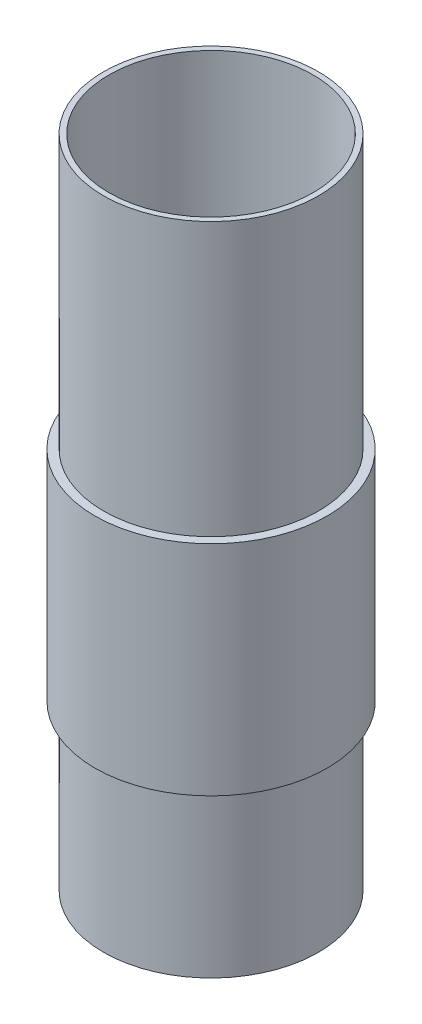
ISO-10303-21;
HEADER;
FILE_DESCRIPTION(('STEP AP214'),'2;1');
FILE_NAME('part.step','',(''),(''),'','','');
FILE_SCHEMA(('AUTOMOTIVE_DESIGN { 1 0 10303 214 1 1 1 1 }'));
ENDSEC;
DATA;
#1=APPLICATION_CONTEXT('core data for automotive mechanical design processes');
#2=APPLICATION_PROTOCOL_DEFINITION('international standard','automotive_design',2000,#1);
#3=PRODUCT_CONTEXT('',#1,'mechanical');
#4=PRODUCT('Part','Part','',(#3));
#5=PRODUCT_RELATED_PRODUCT_CATEGORY('part','',(#4));
#6=PRODUCT_DEFINITION_FORMATION('','',#4);
#7=PRODUCT_DEFINITION_CONTEXT('part definition',#1,'design');
#8=PRODUCT_DEFINITION('design','',#6,#7);
#9=PRODUCT_DEFINITION_SHAPE('','',#8);
#10=(LENGTH_UNIT() NAMED_UNIT(*) SI_UNIT(.MILLI.,.METRE.));
#11=(NAMED_UNIT(*) PLANE_ANGLE_UNIT() SI_UNIT($,.RADIAN.));
#12=(NAMED_UNIT(*) SI_UNIT($,.STERADIAN.) SOLID_ANGLE_UNIT());
#13=UNCERTAINTY_MEASURE_WITH_UNIT(LENGTH_MEASURE(1.E-05),#10,'distance_accuracy_value','');
#14=(GEOMETRIC_REPRESENTATION_CONTEXT(3) GLOBAL_UNCERTAINTY_ASSIGNED_CONTEXT((#13)) GLOBAL_UNIT_ASSIGNED_CONTEXT((#10,
#11,#12)) REPRESENTATION_CONTEXT('',''));
#15=CARTESIAN_POINT('',(0.,0.,0.));
#16=DIRECTION('',(0.,0.,1.));
#17=DIRECTION('',(1.,0.,0.));
#18=AXIS2_PLACEMENT_3D('',#15,#16,#17);
#19=CARTESIAN_POINT('',(0.,152.4,0.));
#20=DIRECTION('',(0.,-1.,0.));
#21=DIRECTION('',(0.,0.,-1.));
#22=AXIS2_PLACEMENT_3D('',#19,#20,#21);
#23=CYLINDRICAL_SURFACE('',#22,25.0063);
#24=CARTESIAN_POINT('',(0.,0.,0.));
#25=DIRECTION('',(0.,1.,0.));
#26=DIRECTION('',(0.,0.,1.));
#27=AXIS2_PLACEMENT_3D('',#24,#25,#26);
#28=CIRCLE('',#27,25.0063);
#29=CARTESIAN_POINT('',(0.,0.,25.0063));
#30=VERTEX_POINT('',#29);
#31=EDGE_CURVE('E54',#30,#30,#28,.T.);
#32=ORIENTED_EDGE('',*,*,#31,.T.);
#33=EDGE_LOOP('',(#32));
#34=FACE_BOUND('',#33,.T.);
#35=CARTESIAN_POINT('',(0.,38.1000000000002,0.));
#36=DIRECTION('',(0.,1.,0.));
#37=DIRECTION('',(0.,0.,1.));
#38=AXIS2_PLACEMENT_3D('',#35,#36,#37);
#39=CIRCLE('',#38,25.0063);
#40=CARTESIAN_POINT('',(0.,38.1000000000002,25.0063));
#41=VERTEX_POINT('',#40);
#42=EDGE_CURVE('E10',#41,#41,#39,.T.);
#43=ORIENTED_EDGE('',*,*,#42,.F.);
#44=EDGE_LOOP('',(#43));
#45=FACE_BOUND('',#44,.T.);
#46=ADVANCED_FACE('F41',(#34,#45),#23,.T.);
#47=CARTESIAN_POINT('',(0.,152.4,0.));
#48=DIRECTION('',(0.,1.,0.));
#49=DIRECTION('',(0.,0.,1.));
#50=AXIS2_PLACEMENT_3D('',#47,#48,#49);
#51=PLANE('',#50);
#52=CARTESIAN_POINT('',(0.,152.4,0.));
#53=DIRECTION('',(0.,1.,0.));
#54=DIRECTION('',(0.,0.,1.));
#55=AXIS2_PLACEMENT_3D('',#52,#53,#54);
#56=CIRCLE('',#55,25.0063);
#57=CARTESIAN_POINT('',(0.,152.4,25.0063));
#58=VERTEX_POINT('',#57);
#59=EDGE_CURVE('E49',#58,#58,#56,.T.);
#60=ORIENTED_EDGE('',*,*,#59,.T.);
#61=EDGE_LOOP('',(#60));
#62=FACE_BOUND('',#61,.T.);
#63=CARTESIAN_POINT('',(0.,152.4,0.));
#64=DIRECTION('',(0.,1.,0.));
#65=DIRECTION('',(0.,0.,1.));
#66=AXIS2_PLACEMENT_3D('',#63,#64,#65);
#67=CIRCLE('',#66,23.749);
#68=CARTESIAN_POINT('',(0.,152.4,23.749));
#69=VERTEX_POINT('',#68);
#70=EDGE_CURVE('E60',#69,#69,#67,.T.);
#71=ORIENTED_EDGE('',*,*,#70,.F.);
#72=EDGE_LOOP('',(#71));
#73=FACE_BOUND('',#72,.T.);
#74=ADVANCED_FACE('F104',(#62,#73),#51,.T.);
#75=CARTESIAN_POINT('',(0.,0.,0.));
#76=DIRECTION('',(0.,1.,0.));
#77=DIRECTION('',(0.,0.,1.));
#78=AXIS2_PLACEMENT_3D('',#75,#76,#77);
#79=PLANE('',#78);
#80=ORIENTED_EDGE('',*,*,#31,.F.);
#81=EDGE_LOOP('',(#80));
#82=FACE_BOUND('',#81,.T.);
#83=CARTESIAN_POINT('',(0.,0.,0.));
#84=DIRECTION('',(0.,1.,0.));
#85=DIRECTION('',(0.,0.,1.));
#86=AXIS2_PLACEMENT_3D('',#83,#84,#85);
#87=CIRCLE('',#86,23.749);
#88=CARTESIAN_POINT('',(0.,0.,23.749));
#89=VERTEX_POINT('',#88);
#90=EDGE_CURVE('E62',#89,#89,#87,.T.);
#91=ORIENTED_EDGE('',*,*,#90,.T.);
#92=EDGE_LOOP('',(#91));
#93=FACE_BOUND('',#92,.T.);
#94=ADVANCED_FACE('F109',(#82,#93),#79,.F.);
#95=CARTESIAN_POINT('',(0.,88.9,0.));
#96=DIRECTION('',(0.,1.,0.));
#97=DIRECTION('',(0.,0.,1.));
#98=AXIS2_PLACEMENT_3D('',#95,#96,#97);
#99=CIRCLE('',#98,25.0063);
#100=CARTESIAN_POINT('',(0.,88.9,25.0063));
#101=VERTEX_POINT('',#100);
#102=EDGE_CURVE('E74',#101,#101,#99,.T.);
#103=ORIENTED_EDGE('',*,*,#102,.T.);
#104=EDGE_LOOP('',(#103));
#105=FACE_BOUND('',#104,.T.);
#106=ORIENTED_EDGE('',*,*,#59,.F.);
#107=EDGE_LOOP('',(#106));
#108=FACE_BOUND('',#107,.T.);
#109=ADVANCED_FACE('F43',(#105,#108),#23,.T.);
#110=CARTESIAN_POINT('',(0.,152.4,0.));
#111=DIRECTION('',(0.,-1.,0.));
#112=DIRECTION('',(0.,0.,-1.));
#113=AXIS2_PLACEMENT_3D('',#110,#111,#112);
#114=CYLINDRICAL_SURFACE('',#113,23.749);
#115=ORIENTED_EDGE('',*,*,#70,.T.);
#116=EDGE_LOOP('',(#115));
#117=FACE_BOUND('',#116,.T.);
#118=ORIENTED_EDGE('',*,*,#90,.F.);
#119=EDGE_LOOP('',(#118));
#120=FACE_BOUND('',#119,.T.);
#121=ADVANCED_FACE('F93',(#117,#120),#114,.F.);
#122=CARTESIAN_POINT('',(0.,38.1000000000002,0.));
#123=DIRECTION('',(0.,1.,0.));
#124=DIRECTION('',(0.,0.,1.));
#125=AXIS2_PLACEMENT_3D('',#122,#123,#124);
#126=CYLINDRICAL_SURFACE('',#125,27.0002);
#127=CARTESIAN_POINT('',(0.,38.1000000000002,0.));
#128=DIRECTION('',(0.,1.,0.));
#129=DIRECTION('',(0.,0.,1.));
#130=AXIS2_PLACEMENT_3D('',#127,#128,#129);
#131=CIRCLE('',#130,27.0002);
#132=CARTESIAN_POINT('',(0.,38.1000000000002,27.0002));
#133=VERTEX_POINT('',#132);
#134=EDGE_CURVE('E66',#133,#133,#131,.T.);
#135=ORIENTED_EDGE('',*,*,#134,.T.);
#136=EDGE_LOOP('',(#135));
#137=FACE_BOUND('',#136,.T.);
#138=CARTESIAN_POINT('',(0.,88.9,0.));
#139=DIRECTION('',(0.,1.,0.));
#140=DIRECTION('',(0.,0.,1.));
#141=AXIS2_PLACEMENT_3D('',#138,#139,#140);
#142=CIRCLE('',#141,27.0002);
#143=CARTESIAN_POINT('',(0.,88.9,27.0002));
#144=VERTEX_POINT('',#143);
#145=EDGE_CURVE('E70',#144,#144,#142,.T.);
#146=ORIENTED_EDGE('',*,*,#145,.F.);
#147=EDGE_LOOP('',(#146));
#148=FACE_BOUND('',#147,.T.);
#149=ADVANCED_FACE('F91',(#137,#148),#126,.T.);
#150=CARTESIAN_POINT('',(0.,38.1000000000002,0.));
#151=DIRECTION('',(0.,1.,0.));
#152=DIRECTION('',(0.,0.,1.));
#153=AXIS2_PLACEMENT_3D('',#150,#151,#152);
#154=PLANE('',#153);
#155=ORIENTED_EDGE('',*,*,#42,.T.);
#156=EDGE_LOOP('',(#155));
#157=FACE_BOUND('',#156,.T.);
#158=ORIENTED_EDGE('',*,*,#134,.F.);
#159=EDGE_LOOP('',(#158));
#160=FACE_BOUND('',#159,.T.);
#161=ADVANCED_FACE('F87',(#157,#160),#154,.F.);
#162=CARTESIAN_POINT('',(0.,88.9,0.));
#163=DIRECTION('',(0.,1.,0.));
#164=DIRECTION('',(0.,0.,1.));
#165=AXIS2_PLACEMENT_3D('',#162,#163,#164);
#166=PLANE('',#165);
#167=ORIENTED_EDGE('',*,*,#102,.F.);
#168=EDGE_LOOP('',(#167));
#169=FACE_BOUND('',#168,.T.);
#170=ORIENTED_EDGE('',*,*,#145,.T.);
#171=EDGE_LOOP('',(#170));
#172=FACE_BOUND('',#171,.T.);
#173=ADVANCED_FACE('F84',(#169,#172),#166,.T.);
#174=CLOSED_SHELL('',(#46,#74,#94,#109,#121,#149,#161,#173));
#175=MANIFOLD_SOLID_BREP('B2',#174);
#176=ADVANCED_BREP_SHAPE_REPRESENTATION('',(#18,#175),#14);
#177=SHAPE_DEFINITION_REPRESENTATION(#9,#176);
ENDSEC;
END-ISO-10303-21;
